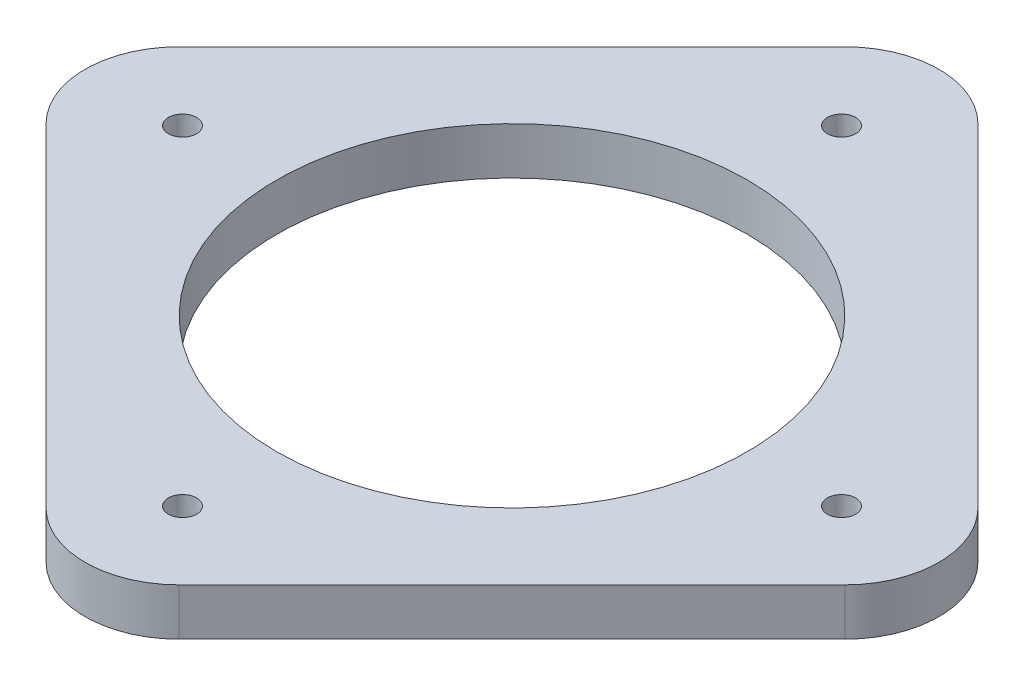
ISO-10303-21;
HEADER;
FILE_DESCRIPTION(('STEP AP214'),'2;1');
FILE_NAME('part.step','',(''),(''),'','','');
FILE_SCHEMA(('AUTOMOTIVE_DESIGN { 1 0 10303 214 1 1 1 1 }'));
ENDSEC;
DATA;
#1=APPLICATION_CONTEXT('core data for automotive mechanical design processes');
#2=APPLICATION_PROTOCOL_DEFINITION('international standard','automotive_design',2000,#1);
#3=PRODUCT_CONTEXT('',#1,'mechanical');
#4=PRODUCT('Part','Part','',(#3));
#5=PRODUCT_RELATED_PRODUCT_CATEGORY('part','',(#4));
#6=PRODUCT_DEFINITION_FORMATION('','',#4);
#7=PRODUCT_DEFINITION_CONTEXT('part definition',#1,'design');
#8=PRODUCT_DEFINITION('design','',#6,#7);
#9=PRODUCT_DEFINITION_SHAPE('','',#8);
#10=(LENGTH_UNIT() NAMED_UNIT(*) SI_UNIT(.MILLI.,.METRE.));
#11=(NAMED_UNIT(*) PLANE_ANGLE_UNIT() SI_UNIT($,.RADIAN.));
#12=(NAMED_UNIT(*) SI_UNIT($,.STERADIAN.) SOLID_ANGLE_UNIT());
#13=UNCERTAINTY_MEASURE_WITH_UNIT(LENGTH_MEASURE(1.E-05),#10,'distance_accuracy_value','');
#14=(GEOMETRIC_REPRESENTATION_CONTEXT(3) GLOBAL_UNCERTAINTY_ASSIGNED_CONTEXT((#13)) GLOBAL_UNIT_ASSIGNED_CONTEXT((#10,
#11,#12)) REPRESENTATION_CONTEXT('',''));
#15=CARTESIAN_POINT('',(0.,0.,0.));
#16=DIRECTION('',(0.,0.,1.));
#17=DIRECTION('',(1.,0.,0.));
#18=AXIS2_PLACEMENT_3D('',#15,#16,#17);
#19=CARTESIAN_POINT('',(0.,5.,35.3553390593274));
#20=DIRECTION('',(0.,1.,0.));
#21=DIRECTION('',(0.,0.,1.));
#22=AXIS2_PLACEMENT_3D('',#19,#20,#21);
#23=PLANE('',#22);
#24=CARTESIAN_POINT('',(-35.,5.,-2.44403693719019E-13));
#25=DIRECTION('',(0.,1.,0.));
#26=DIRECTION('',(0.,0.,1.));
#27=AXIS2_PLACEMENT_3D('',#24,#25,#26);
#28=CIRCLE('',#27,1.5);
#29=CARTESIAN_POINT('',(-35.,5.,1.49999999999976));
#30=VERTEX_POINT('',#29);
#31=EDGE_CURVE('E200',#30,#30,#28,.T.);
#32=ORIENTED_EDGE('',*,*,#31,.F.);
#33=EDGE_LOOP('',(#32));
#34=FACE_BOUND('',#33,.T.);
#35=CARTESIAN_POINT('',(35.,5.,0.));
#36=DIRECTION('',(0.,1.,0.));
#37=DIRECTION('',(0.,0.,1.));
#38=AXIS2_PLACEMENT_3D('',#35,#36,#37);
#39=CIRCLE('',#38,1.5);
#40=CARTESIAN_POINT('',(35.,5.,1.5));
#41=VERTEX_POINT('',#40);
#42=EDGE_CURVE('E188',#41,#41,#39,.T.);
#43=ORIENTED_EDGE('',*,*,#42,.F.);
#44=EDGE_LOOP('',(#43));
#45=FACE_BOUND('',#44,.T.);
#46=CARTESIAN_POINT('',(0.,5.,35.3553390593274));
#47=DIRECTION('',(0.,1.,0.));
#48=DIRECTION('',(0.,0.,1.));
#49=AXIS2_PLACEMENT_3D('',#46,#47,#48);
#50=CIRCLE('',#49,9.99999999999998);
#51=CARTESIAN_POINT('',(-7.07106781186546,5.,42.4264068711929));
#52=VERTEX_POINT('',#51);
#53=CARTESIAN_POINT('',(7.07106781186547,5.,42.4264068711929));
#54=VERTEX_POINT('',#53);
#55=EDGE_CURVE('E151',#52,#54,#50,.T.);
#56=ORIENTED_EDGE('',*,*,#55,.T.);
#57=DIRECTION('',(0.707106781186547,0.,-0.707106781186548));
#58=VECTOR('',#57,1.);
#59=CARTESIAN_POINT('',(7.07106781186547,5.,42.4264068711929));
#60=LINE('',#59,#58);
#61=CARTESIAN_POINT('',(42.4264068711929,5.,7.07106781186543));
#62=VERTEX_POINT('',#61);
#63=EDGE_CURVE('E99',#54,#62,#60,.T.);
#64=ORIENTED_EDGE('',*,*,#63,.T.);
#65=CARTESIAN_POINT('',(35.3553390593274,5.,0.));
#66=DIRECTION('',(0.,1.,0.));
#67=DIRECTION('',(0.,0.,1.));
#68=AXIS2_PLACEMENT_3D('',#65,#66,#67);
#69=CIRCLE('',#68,9.99999999999998);
#70=CARTESIAN_POINT('',(42.4264068711929,5.,-7.07106781186549));
#71=VERTEX_POINT('',#70);
#72=EDGE_CURVE('E166',#62,#71,#69,.T.);
#73=ORIENTED_EDGE('',*,*,#72,.T.);
#74=DIRECTION('',(-0.707106781186548,0.,-0.707106781186547));
#75=VECTOR('',#74,1.);
#76=CARTESIAN_POINT('',(42.4264068711929,5.,-7.07106781186549));
#77=LINE('',#76,#75);
#78=CARTESIAN_POINT('',(7.07106781186549,5.,-42.4264068711929));
#79=VERTEX_POINT('',#78);
#80=EDGE_CURVE('E179',#71,#79,#77,.T.);
#81=ORIENTED_EDGE('',*,*,#80,.T.);
#82=CARTESIAN_POINT('',(0.,5.,-35.3553390593274));
#83=DIRECTION('',(0.,1.,0.));
#84=DIRECTION('',(0.,0.,1.));
#85=AXIS2_PLACEMENT_3D('',#82,#83,#84);
#86=CIRCLE('',#85,9.99999999999999);
#87=CARTESIAN_POINT('',(-7.07106781186545,5.,-42.4264068711929));
#88=VERTEX_POINT('',#87);
#89=EDGE_CURVE('E118',#79,#88,#86,.T.);
#90=ORIENTED_EDGE('',*,*,#89,.T.);
#91=DIRECTION('',(-0.707106781186547,0.,0.707106781186548));
#92=VECTOR('',#91,1.);
#93=CARTESIAN_POINT('',(-7.07106781186545,5.,-42.4264068711929));
#94=LINE('',#93,#92);
#95=CARTESIAN_POINT('',(-42.4264068711929,5.,-7.07106781186546));
#96=VERTEX_POINT('',#95);
#97=EDGE_CURVE('E112',#88,#96,#94,.T.);
#98=ORIENTED_EDGE('',*,*,#97,.T.);
#99=CARTESIAN_POINT('',(-35.3553390593274,5.,0.));
#100=DIRECTION('',(0.,1.,0.));
#101=DIRECTION('',(0.,0.,-1.));
#102=AXIS2_PLACEMENT_3D('',#99,#100,#101);
#103=CIRCLE('',#102,10.);
#104=CARTESIAN_POINT('',(-42.4264068711929,5.,7.07106781186549));
#105=VERTEX_POINT('',#104);
#106=EDGE_CURVE('E116',#96,#105,#103,.T.);
#107=ORIENTED_EDGE('',*,*,#106,.T.);
#108=DIRECTION('',(0.707106781186548,0.,0.707106781186547));
#109=VECTOR('',#108,1.);
#110=CARTESIAN_POINT('',(-42.4264068711929,5.,7.07106781186549));
#111=LINE('',#110,#109);
#112=EDGE_CURVE('E56',#105,#52,#111,.T.);
#113=ORIENTED_EDGE('',*,*,#112,.T.);
#114=EDGE_LOOP('',(#56,#64,#73,#81,#90,#98,#107,#113));
#115=FACE_BOUND('',#114,.T.);
#116=CARTESIAN_POINT('',(0.,5.,0.));
#117=DIRECTION('',(0.,1.,0.));
#118=DIRECTION('',(0.,0.,1.));
#119=AXIS2_PLACEMENT_3D('',#116,#117,#118);
#120=CIRCLE('',#119,25.);
#121=CARTESIAN_POINT('',(0.,5.,25.));
#122=VERTEX_POINT('',#121);
#123=EDGE_CURVE('E140',#122,#122,#120,.T.);
#124=ORIENTED_EDGE('',*,*,#123,.F.);
#125=EDGE_LOOP('',(#124));
#126=FACE_BOUND('',#125,.T.);
#127=CARTESIAN_POINT('',(-1.2220184685951E-13,5.,35.));
#128=DIRECTION('',(0.,1.,0.));
#129=DIRECTION('',(0.,0.,1.));
#130=AXIS2_PLACEMENT_3D('',#127,#128,#129);
#131=CIRCLE('',#130,1.5);
#132=CARTESIAN_POINT('',(-1.2220184685951E-13,5.,36.5));
#133=VERTEX_POINT('',#132);
#134=EDGE_CURVE('E194',#133,#133,#131,.T.);
#135=ORIENTED_EDGE('',*,*,#134,.F.);
#136=EDGE_LOOP('',(#135));
#137=FACE_BOUND('',#136,.T.);
#138=CARTESIAN_POINT('',(3.66605540578529E-13,5.,-35.));
#139=DIRECTION('',(0.,1.,0.));
#140=DIRECTION('',(0.,0.,1.));
#141=AXIS2_PLACEMENT_3D('',#138,#139,#140);
#142=CIRCLE('',#141,1.50000000000001);
#143=CARTESIAN_POINT('',(3.66605540578529E-13,5.,-33.5));
#144=VERTEX_POINT('',#143);
#145=EDGE_CURVE('E206',#144,#144,#142,.T.);
#146=ORIENTED_EDGE('',*,*,#145,.F.);
#147=EDGE_LOOP('',(#146));
#148=FACE_BOUND('',#147,.T.);
#149=ADVANCED_FACE('F39',(#34,#45,#115,#126,#137,#148),#23,.T.);
#150=CARTESIAN_POINT('',(0.,0.,35.3553390593274));
#151=DIRECTION('',(0.,1.,0.));
#152=DIRECTION('',(0.,0.,1.));
#153=AXIS2_PLACEMENT_3D('',#150,#151,#152);
#154=PLANE('',#153);
#155=CARTESIAN_POINT('',(0.,0.,35.3553390593274));
#156=DIRECTION('',(0.,1.,0.));
#157=DIRECTION('',(0.,0.,1.));
#158=AXIS2_PLACEMENT_3D('',#155,#156,#157);
#159=CIRCLE('',#158,9.99999999999998);
#160=CARTESIAN_POINT('',(-7.07106781186546,0.,42.4264068711929));
#161=VERTEX_POINT('',#160);
#162=CARTESIAN_POINT('',(7.07106781186547,0.,42.4264068711929));
#163=VERTEX_POINT('',#162);
#164=EDGE_CURVE('E136',#161,#163,#159,.T.);
#165=ORIENTED_EDGE('',*,*,#164,.F.);
#166=DIRECTION('',(0.707106781186548,0.,0.707106781186547));
#167=VECTOR('',#166,1.);
#168=CARTESIAN_POINT('',(-42.4264068711929,0.,7.07106781186549));
#169=LINE('',#168,#167);
#170=CARTESIAN_POINT('',(-42.4264068711929,0.,7.07106781186549));
#171=VERTEX_POINT('',#170);
#172=EDGE_CURVE('E91',#171,#161,#169,.T.);
#173=ORIENTED_EDGE('',*,*,#172,.F.);
#174=CARTESIAN_POINT('',(-35.3553390593274,0.,0.));
#175=DIRECTION('',(0.,1.,0.));
#176=DIRECTION('',(0.,0.,-1.));
#177=AXIS2_PLACEMENT_3D('',#174,#175,#176);
#178=CIRCLE('',#177,10.);
#179=CARTESIAN_POINT('',(-42.4264068711929,0.,-7.07106781186546));
#180=VERTEX_POINT('',#179);
#181=EDGE_CURVE('E85',#180,#171,#178,.T.);
#182=ORIENTED_EDGE('',*,*,#181,.F.);
#183=DIRECTION('',(-0.707106781186547,0.,0.707106781186548));
#184=VECTOR('',#183,1.);
#185=CARTESIAN_POINT('',(-7.07106781186545,0.,-42.4264068711929));
#186=LINE('',#185,#184);
#187=CARTESIAN_POINT('',(-7.07106781186545,0.,-42.4264068711929));
#188=VERTEX_POINT('',#187);
#189=EDGE_CURVE('E126',#188,#180,#186,.T.);
#190=ORIENTED_EDGE('',*,*,#189,.F.);
#191=CARTESIAN_POINT('',(0.,0.,-35.3553390593274));
#192=DIRECTION('',(0.,1.,0.));
#193=DIRECTION('',(0.,0.,1.));
#194=AXIS2_PLACEMENT_3D('',#191,#192,#193);
#195=CIRCLE('',#194,9.99999999999999);
#196=CARTESIAN_POINT('',(7.07106781186549,0.,-42.4264068711929));
#197=VERTEX_POINT('',#196);
#198=EDGE_CURVE('E146',#197,#188,#195,.T.);
#199=ORIENTED_EDGE('',*,*,#198,.F.);
#200=DIRECTION('',(-0.707106781186548,0.,-0.707106781186547));
#201=VECTOR('',#200,1.);
#202=CARTESIAN_POINT('',(42.4264068711929,0.,-7.07106781186549));
#203=LINE('',#202,#201);
#204=CARTESIAN_POINT('',(42.4264068711929,0.,-7.07106781186549));
#205=VERTEX_POINT('',#204);
#206=EDGE_CURVE('E144',#205,#197,#203,.T.);
#207=ORIENTED_EDGE('',*,*,#206,.F.);
#208=CARTESIAN_POINT('',(35.3553390593274,0.,0.));
#209=DIRECTION('',(0.,1.,0.));
#210=DIRECTION('',(0.,0.,1.));
#211=AXIS2_PLACEMENT_3D('',#208,#209,#210);
#212=CIRCLE('',#211,9.99999999999998);
#213=CARTESIAN_POINT('',(42.4264068711929,0.,7.07106781186543));
#214=VERTEX_POINT('',#213);
#215=EDGE_CURVE('E142',#214,#205,#212,.T.);
#216=ORIENTED_EDGE('',*,*,#215,.F.);
#217=DIRECTION('',(0.707106781186547,0.,-0.707106781186548));
#218=VECTOR('',#217,1.);
#219=CARTESIAN_POINT('',(7.07106781186547,0.,42.4264068711929));
#220=LINE('',#219,#218);
#221=EDGE_CURVE('E139',#163,#214,#220,.T.);
#222=ORIENTED_EDGE('',*,*,#221,.F.);
#223=EDGE_LOOP('',(#165,#173,#182,#190,#199,#207,#216,#222));
#224=FACE_BOUND('',#223,.T.);
#225=CARTESIAN_POINT('',(0.,0.,0.));
#226=DIRECTION('',(0.,1.,0.));
#227=DIRECTION('',(0.,0.,1.));
#228=AXIS2_PLACEMENT_3D('',#225,#226,#227);
#229=CIRCLE('',#228,25.);
#230=CARTESIAN_POINT('',(0.,0.,25.));
#231=VERTEX_POINT('',#230);
#232=EDGE_CURVE('E185',#231,#231,#229,.T.);
#233=ORIENTED_EDGE('',*,*,#232,.T.);
#234=EDGE_LOOP('',(#233));
#235=FACE_BOUND('',#234,.T.);
#236=CARTESIAN_POINT('',(35.,0.,0.));
#237=DIRECTION('',(0.,1.,0.));
#238=DIRECTION('',(0.,0.,1.));
#239=AXIS2_PLACEMENT_3D('',#236,#237,#238);
#240=CIRCLE('',#239,1.5);
#241=CARTESIAN_POINT('',(35.,0.,1.5));
#242=VERTEX_POINT('',#241);
#243=EDGE_CURVE('E191',#242,#242,#240,.T.);
#244=ORIENTED_EDGE('',*,*,#243,.T.);
#245=EDGE_LOOP('',(#244));
#246=FACE_BOUND('',#245,.T.);
#247=CARTESIAN_POINT('',(-1.2220184685951E-13,0.,35.));
#248=DIRECTION('',(0.,1.,0.));
#249=DIRECTION('',(0.,0.,1.));
#250=AXIS2_PLACEMENT_3D('',#247,#248,#249);
#251=CIRCLE('',#250,1.5);
#252=CARTESIAN_POINT('',(-1.2220184685951E-13,0.,36.5));
#253=VERTEX_POINT('',#252);
#254=EDGE_CURVE('E197',#253,#253,#251,.T.);
#255=ORIENTED_EDGE('',*,*,#254,.T.);
#256=EDGE_LOOP('',(#255));
#257=FACE_BOUND('',#256,.T.);
#258=CARTESIAN_POINT('',(-35.,0.,-2.44403693719019E-13));
#259=DIRECTION('',(0.,1.,0.));
#260=DIRECTION('',(0.,0.,1.));
#261=AXIS2_PLACEMENT_3D('',#258,#259,#260);
#262=CIRCLE('',#261,1.5);
#263=CARTESIAN_POINT('',(-35.,0.,1.49999999999976));
#264=VERTEX_POINT('',#263);
#265=EDGE_CURVE('E203',#264,#264,#262,.T.);
#266=ORIENTED_EDGE('',*,*,#265,.T.);
#267=EDGE_LOOP('',(#266));
#268=FACE_BOUND('',#267,.T.);
#269=CARTESIAN_POINT('',(3.66605540578529E-13,0.,-35.));
#270=DIRECTION('',(0.,1.,0.));
#271=DIRECTION('',(0.,0.,1.));
#272=AXIS2_PLACEMENT_3D('',#269,#270,#271);
#273=CIRCLE('',#272,1.50000000000001);
#274=CARTESIAN_POINT('',(3.66605540578529E-13,0.,-33.5));
#275=VERTEX_POINT('',#274);
#276=EDGE_CURVE('E209',#275,#275,#273,.T.);
#277=ORIENTED_EDGE('',*,*,#276,.T.);
#278=EDGE_LOOP('',(#277));
#279=FACE_BOUND('',#278,.T.);
#280=ADVANCED_FACE('F170',(#224,#235,#246,#257,#268,#279),#154,.F.);
#281=CARTESIAN_POINT('',(0.,5.,35.3553390593274));
#282=DIRECTION('',(0.,-1.,0.));
#283=DIRECTION('',(0.,0.,-1.));
#284=AXIS2_PLACEMENT_3D('',#281,#282,#283);
#285=CYLINDRICAL_SURFACE('',#284,9.99999999999998);
#286=ORIENTED_EDGE('',*,*,#164,.T.);
#287=DIRECTION('',(0.,-1.,0.));
#288=VECTOR('',#287,1.);
#289=CARTESIAN_POINT('',(7.07106781186547,5.,42.4264068711929));
#290=LINE('',#289,#288);
#291=EDGE_CURVE('E11',#54,#163,#290,.T.);
#292=ORIENTED_EDGE('',*,*,#291,.F.);
#293=ORIENTED_EDGE('',*,*,#55,.F.);
#294=DIRECTION('',(0.,-1.,0.));
#295=VECTOR('',#294,1.);
#296=CARTESIAN_POINT('',(-7.07106781186546,5.,42.4264068711929));
#297=LINE('',#296,#295);
#298=EDGE_CURVE('E132',#52,#161,#297,.T.);
#299=ORIENTED_EDGE('',*,*,#298,.T.);
#300=EDGE_LOOP('',(#286,#292,#293,#299));
#301=FACE_BOUND('',#300,.T.);
#302=ADVANCED_FACE('F41',(#301),#285,.T.);
#303=CARTESIAN_POINT('',(7.07106781186547,5.,42.4264068711929));
#304=DIRECTION('',(-0.707106781186548,0.,-0.707106781186547));
#305=DIRECTION('',(-0.707106781186547,0.,0.707106781186548));
#306=AXIS2_PLACEMENT_3D('',#303,#304,#305);
#307=PLANE('',#306);
#308=ORIENTED_EDGE('',*,*,#221,.T.);
#309=DIRECTION('',(0.,-1.,0.));
#310=VECTOR('',#309,1.);
#311=CARTESIAN_POINT('',(42.4264068711929,5.,7.07106781186543));
#312=LINE('',#311,#310);
#313=EDGE_CURVE('E48',#62,#214,#312,.T.);
#314=ORIENTED_EDGE('',*,*,#313,.F.);
#315=ORIENTED_EDGE('',*,*,#63,.F.);
#316=ORIENTED_EDGE('',*,*,#291,.T.);
#317=EDGE_LOOP('',(#308,#314,#315,#316));
#318=FACE_BOUND('',#317,.T.);
#319=ADVANCED_FACE('F243',(#318),#307,.F.);
#320=CARTESIAN_POINT('',(35.3553390593274,5.,0.));
#321=DIRECTION('',(0.,-1.,0.));
#322=DIRECTION('',(0.,0.,-1.));
#323=AXIS2_PLACEMENT_3D('',#320,#321,#322);
#324=CYLINDRICAL_SURFACE('',#323,9.99999999999998);
#325=ORIENTED_EDGE('',*,*,#215,.T.);
#326=DIRECTION('',(0.,-1.,0.));
#327=VECTOR('',#326,1.);
#328=CARTESIAN_POINT('',(42.4264068711929,5.,-7.07106781186549));
#329=LINE('',#328,#327);
#330=EDGE_CURVE('E158',#71,#205,#329,.T.);
#331=ORIENTED_EDGE('',*,*,#330,.F.);
#332=ORIENTED_EDGE('',*,*,#72,.F.);
#333=ORIENTED_EDGE('',*,*,#313,.T.);
#334=EDGE_LOOP('',(#325,#331,#332,#333));
#335=FACE_BOUND('',#334,.T.);
#336=ADVANCED_FACE('F164',(#335),#324,.T.);
#337=CARTESIAN_POINT('',(42.4264068711929,5.,-7.07106781186549));
#338=DIRECTION('',(-0.707106781186547,0.,0.707106781186548));
#339=DIRECTION('',(0.707106781186548,0.,0.707106781186547));
#340=AXIS2_PLACEMENT_3D('',#337,#338,#339);
#341=PLANE('',#340);
#342=ORIENTED_EDGE('',*,*,#206,.T.);
#343=DIRECTION('',(0.,-1.,0.));
#344=VECTOR('',#343,1.);
#345=CARTESIAN_POINT('',(7.07106781186549,5.,-42.4264068711929));
#346=LINE('',#345,#344);
#347=EDGE_CURVE('E155',#79,#197,#346,.T.);
#348=ORIENTED_EDGE('',*,*,#347,.F.);
#349=ORIENTED_EDGE('',*,*,#80,.F.);
#350=ORIENTED_EDGE('',*,*,#330,.T.);
#351=EDGE_LOOP('',(#342,#348,#349,#350));
#352=FACE_BOUND('',#351,.T.);
#353=ADVANCED_FACE('F175',(#352),#341,.F.);
#354=CARTESIAN_POINT('',(0.,5.,-35.3553390593274));
#355=DIRECTION('',(0.,-1.,0.));
#356=DIRECTION('',(0.,0.,-1.));
#357=AXIS2_PLACEMENT_3D('',#354,#355,#356);
#358=CYLINDRICAL_SURFACE('',#357,9.99999999999999);
#359=ORIENTED_EDGE('',*,*,#198,.T.);
#360=DIRECTION('',(0.,-1.,0.));
#361=VECTOR('',#360,1.);
#362=CARTESIAN_POINT('',(-7.07106781186545,5.,-42.4264068711929));
#363=LINE('',#362,#361);
#364=EDGE_CURVE('E127',#88,#188,#363,.T.);
#365=ORIENTED_EDGE('',*,*,#364,.F.);
#366=ORIENTED_EDGE('',*,*,#89,.F.);
#367=ORIENTED_EDGE('',*,*,#347,.T.);
#368=EDGE_LOOP('',(#359,#365,#366,#367));
#369=FACE_BOUND('',#368,.T.);
#370=ADVANCED_FACE('F178',(#369),#358,.T.);
#371=CARTESIAN_POINT('',(-7.07106781186545,5.,-42.4264068711929));
#372=DIRECTION('',(0.707106781186548,0.,0.707106781186547));
#373=DIRECTION('',(0.707106781186547,0.,-0.707106781186548));
#374=AXIS2_PLACEMENT_3D('',#371,#372,#373);
#375=PLANE('',#374);
#376=ORIENTED_EDGE('',*,*,#189,.T.);
#377=DIRECTION('',(0.,-1.,0.));
#378=VECTOR('',#377,1.);
#379=CARTESIAN_POINT('',(-42.4264068711929,5.,-7.07106781186546));
#380=LINE('',#379,#378);
#381=EDGE_CURVE('E123',#96,#180,#380,.T.);
#382=ORIENTED_EDGE('',*,*,#381,.F.);
#383=ORIENTED_EDGE('',*,*,#97,.F.);
#384=ORIENTED_EDGE('',*,*,#364,.T.);
#385=EDGE_LOOP('',(#376,#382,#383,#384));
#386=FACE_BOUND('',#385,.T.);
#387=ADVANCED_FACE('F124',(#386),#375,.F.);
#388=CARTESIAN_POINT('',(-35.3553390593274,5.,0.));
#389=DIRECTION('',(0.,-1.,0.));
#390=DIRECTION('',(0.,0.,-1.));
#391=AXIS2_PLACEMENT_3D('',#388,#389,#390);
#392=CYLINDRICAL_SURFACE('',#391,10.);
#393=ORIENTED_EDGE('',*,*,#181,.T.);
#394=DIRECTION('',(0.,-1.,0.));
#395=VECTOR('',#394,1.);
#396=CARTESIAN_POINT('',(-42.4264068711929,5.,7.07106781186549));
#397=LINE('',#396,#395);
#398=EDGE_CURVE('E128',#105,#171,#397,.T.);
#399=ORIENTED_EDGE('',*,*,#398,.F.);
#400=ORIENTED_EDGE('',*,*,#106,.F.);
#401=ORIENTED_EDGE('',*,*,#381,.T.);
#402=EDGE_LOOP('',(#393,#399,#400,#401));
#403=FACE_BOUND('',#402,.T.);
#404=ADVANCED_FACE('F130',(#403),#392,.T.);
#405=CARTESIAN_POINT('',(-42.4264068711929,5.,7.07106781186549));
#406=DIRECTION('',(0.707106781186547,0.,-0.707106781186548));
#407=DIRECTION('',(-0.707106781186548,0.,-0.707106781186547));
#408=AXIS2_PLACEMENT_3D('',#405,#406,#407);
#409=PLANE('',#408);
#410=ORIENTED_EDGE('',*,*,#172,.T.);
#411=ORIENTED_EDGE('',*,*,#298,.F.);
#412=ORIENTED_EDGE('',*,*,#112,.F.);
#413=ORIENTED_EDGE('',*,*,#398,.T.);
#414=EDGE_LOOP('',(#410,#411,#412,#413));
#415=FACE_BOUND('',#414,.T.);
#416=ADVANCED_FACE('F231',(#415),#409,.F.);
#417=CARTESIAN_POINT('',(0.,5.,0.));
#418=DIRECTION('',(0.,-1.,0.));
#419=DIRECTION('',(0.,0.,-1.));
#420=AXIS2_PLACEMENT_3D('',#417,#418,#419);
#421=CYLINDRICAL_SURFACE('',#420,25.);
#422=ORIENTED_EDGE('',*,*,#123,.T.);
#423=EDGE_LOOP('',(#422));
#424=FACE_BOUND('',#423,.T.);
#425=ORIENTED_EDGE('',*,*,#232,.F.);
#426=EDGE_LOOP('',(#425));
#427=FACE_BOUND('',#426,.T.);
#428=ADVANCED_FACE('F228',(#424,#427),#421,.F.);
#429=CARTESIAN_POINT('',(35.,5.,0.));
#430=DIRECTION('',(0.,-1.,0.));
#431=DIRECTION('',(0.,0.,-1.));
#432=AXIS2_PLACEMENT_3D('',#429,#430,#431);
#433=CYLINDRICAL_SURFACE('',#432,1.5);
#434=ORIENTED_EDGE('',*,*,#42,.T.);
#435=EDGE_LOOP('',(#434));
#436=FACE_BOUND('',#435,.T.);
#437=ORIENTED_EDGE('',*,*,#243,.F.);
#438=EDGE_LOOP('',(#437));
#439=FACE_BOUND('',#438,.T.);
#440=ADVANCED_FACE('F306',(#436,#439),#433,.F.);
#441=CARTESIAN_POINT('',(-1.2220184685951E-13,5.,35.));
#442=DIRECTION('',(0.,-1.,0.));
#443=DIRECTION('',(0.,0.,-1.));
#444=AXIS2_PLACEMENT_3D('',#441,#442,#443);
#445=CYLINDRICAL_SURFACE('',#444,1.5);
#446=ORIENTED_EDGE('',*,*,#134,.T.);
#447=EDGE_LOOP('',(#446));
#448=FACE_BOUND('',#447,.T.);
#449=ORIENTED_EDGE('',*,*,#254,.F.);
#450=EDGE_LOOP('',(#449));
#451=FACE_BOUND('',#450,.T.);
#452=ADVANCED_FACE('F314',(#448,#451),#445,.F.);
#453=CARTESIAN_POINT('',(-35.,5.,-2.44403693719019E-13));
#454=DIRECTION('',(0.,-1.,0.));
#455=DIRECTION('',(0.,0.,-1.));
#456=AXIS2_PLACEMENT_3D('',#453,#454,#455);
#457=CYLINDRICAL_SURFACE('',#456,1.5);
#458=ORIENTED_EDGE('',*,*,#31,.T.);
#459=EDGE_LOOP('',(#458));
#460=FACE_BOUND('',#459,.T.);
#461=ORIENTED_EDGE('',*,*,#265,.F.);
#462=EDGE_LOOP('',(#461));
#463=FACE_BOUND('',#462,.T.);
#464=ADVANCED_FACE('F322',(#460,#463),#457,.F.);
#465=CARTESIAN_POINT('',(3.66605540578529E-13,5.,-35.));
#466=DIRECTION('',(0.,-1.,0.));
#467=DIRECTION('',(0.,0.,-1.));
#468=AXIS2_PLACEMENT_3D('',#465,#466,#467);
#469=CYLINDRICAL_SURFACE('',#468,1.50000000000001);
#470=ORIENTED_EDGE('',*,*,#145,.T.);
#471=EDGE_LOOP('',(#470));
#472=FACE_BOUND('',#471,.T.);
#473=ORIENTED_EDGE('',*,*,#276,.F.);
#474=EDGE_LOOP('',(#473));
#475=FACE_BOUND('',#474,.T.);
#476=ADVANCED_FACE('F215',(#472,#475),#469,.F.);
#477=CLOSED_SHELL('',(#149,#280,#302,#319,#336,#353,#370,#387,#404,#416,#428,#440,#452,#464,#476));
#478=MANIFOLD_SOLID_BREP('B2',#477);
#479=ADVANCED_BREP_SHAPE_REPRESENTATION('',(#18,#478),#14);
#480=SHAPE_DEFINITION_REPRESENTATION(#9,#479);
ENDSEC;
END-ISO-10303-21;
